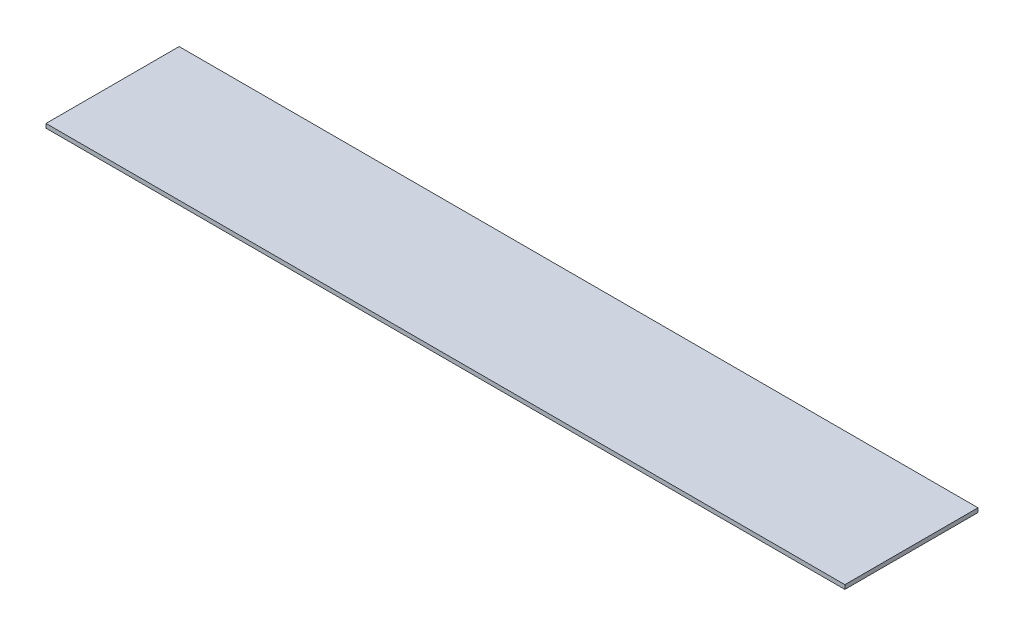
ISO-10303-21;
HEADER;
FILE_DESCRIPTION(('STEP AP214'),'2;1');
FILE_NAME('part.step','',(''),(''),'','','');
FILE_SCHEMA(('AUTOMOTIVE_DESIGN { 1 0 10303 214 1 1 1 1 }'));
ENDSEC;
DATA;
#1=APPLICATION_CONTEXT('core data for automotive mechanical design processes');
#2=APPLICATION_PROTOCOL_DEFINITION('international standard','automotive_design',2000,#1);
#3=PRODUCT_CONTEXT('',#1,'mechanical');
#4=PRODUCT('Part','Part','',(#3));
#5=PRODUCT_RELATED_PRODUCT_CATEGORY('part','',(#4));
#6=PRODUCT_DEFINITION_FORMATION('','',#4);
#7=PRODUCT_DEFINITION_CONTEXT('part definition',#1,'design');
#8=PRODUCT_DEFINITION('design','',#6,#7);
#9=PRODUCT_DEFINITION_SHAPE('','',#8);
#10=(LENGTH_UNIT() NAMED_UNIT(*) SI_UNIT(.MILLI.,.METRE.));
#11=(NAMED_UNIT(*) PLANE_ANGLE_UNIT() SI_UNIT($,.RADIAN.));
#12=(NAMED_UNIT(*) SI_UNIT($,.STERADIAN.) SOLID_ANGLE_UNIT());
#13=UNCERTAINTY_MEASURE_WITH_UNIT(LENGTH_MEASURE(1.E-05),#10,'distance_accuracy_value','');
#14=(GEOMETRIC_REPRESENTATION_CONTEXT(3) GLOBAL_UNCERTAINTY_ASSIGNED_CONTEXT((#13)) GLOBAL_UNIT_ASSIGNED_CONTEXT((#10,
#11,#12)) REPRESENTATION_CONTEXT('',''));
#15=CARTESIAN_POINT('',(0.,0.,0.));
#16=DIRECTION('',(0.,0.,1.));
#17=DIRECTION('',(1.,0.,0.));
#18=AXIS2_PLACEMENT_3D('',#15,#16,#17);
#19=CARTESIAN_POINT('',(0.,1.5875,0.));
#20=DIRECTION('',(1.,0.,0.));
#21=DIRECTION('',(0.,0.,-1.));
#22=AXIS2_PLACEMENT_3D('',#19,#20,#21);
#23=PLANE('',#22);
#24=DIRECTION('',(0.,0.,1.));
#25=VECTOR('',#24,1.);
#26=CARTESIAN_POINT('',(0.,0.,0.));
#27=LINE('',#26,#25);
#28=CARTESIAN_POINT('',(0.,0.,-50.8));
#29=VERTEX_POINT('',#28);
#30=CARTESIAN_POINT('',(0.,0.,0.));
#31=VERTEX_POINT('',#30);
#32=EDGE_CURVE('E96',#29,#31,#27,.T.);
#33=ORIENTED_EDGE('',*,*,#32,.T.);
#34=DIRECTION('',(0.,-1.,0.));
#35=VECTOR('',#34,1.);
#36=CARTESIAN_POINT('',(0.,1.5875,0.));
#37=LINE('',#36,#35);
#38=CARTESIAN_POINT('',(0.,1.5875,0.));
#39=VERTEX_POINT('',#38);
#40=EDGE_CURVE('E11',#39,#31,#37,.T.);
#41=ORIENTED_EDGE('',*,*,#40,.F.);
#42=DIRECTION('',(0.,0.,1.));
#43=VECTOR('',#42,1.);
#44=CARTESIAN_POINT('',(0.,1.5875,0.));
#45=LINE('',#44,#43);
#46=CARTESIAN_POINT('',(0.,1.5875,-50.8));
#47=VERTEX_POINT('',#46);
#48=EDGE_CURVE('E84',#47,#39,#45,.T.);
#49=ORIENTED_EDGE('',*,*,#48,.F.);
#50=DIRECTION('',(0.,-1.,0.));
#51=VECTOR('',#50,1.);
#52=CARTESIAN_POINT('',(0.,1.5875,-50.8));
#53=LINE('',#52,#51);
#54=EDGE_CURVE('E92',#47,#29,#53,.T.);
#55=ORIENTED_EDGE('',*,*,#54,.T.);
#56=EDGE_LOOP('',(#33,#41,#49,#55));
#57=FACE_BOUND('',#56,.T.);
#58=ADVANCED_FACE('F33',(#57),#23,.F.);
#59=CARTESIAN_POINT('',(0.,1.5875,0.));
#60=DIRECTION('',(0.,0.,-1.));
#61=DIRECTION('',(-1.,0.,0.));
#62=AXIS2_PLACEMENT_3D('',#59,#60,#61);
#63=PLANE('',#62);
#64=DIRECTION('',(1.,0.,0.));
#65=VECTOR('',#64,1.);
#66=CARTESIAN_POINT('',(0.,0.,0.));
#67=LINE('',#66,#65);
#68=CARTESIAN_POINT('',(304.8,0.,0.));
#69=VERTEX_POINT('',#68);
#70=EDGE_CURVE('E88',#31,#69,#67,.T.);
#71=ORIENTED_EDGE('',*,*,#70,.T.);
#72=DIRECTION('',(0.,-1.,0.));
#73=VECTOR('',#72,1.);
#74=CARTESIAN_POINT('',(304.8,1.5875,0.));
#75=LINE('',#74,#73);
#76=CARTESIAN_POINT('',(304.8,1.5875,0.));
#77=VERTEX_POINT('',#76);
#78=EDGE_CURVE('E41',#77,#69,#75,.T.);
#79=ORIENTED_EDGE('',*,*,#78,.F.);
#80=DIRECTION('',(1.,0.,0.));
#81=VECTOR('',#80,1.);
#82=CARTESIAN_POINT('',(0.,1.5875,0.));
#83=LINE('',#82,#81);
#84=EDGE_CURVE('E79',#39,#77,#83,.T.);
#85=ORIENTED_EDGE('',*,*,#84,.F.);
#86=ORIENTED_EDGE('',*,*,#40,.T.);
#87=EDGE_LOOP('',(#71,#79,#85,#86));
#88=FACE_BOUND('',#87,.T.);
#89=ADVANCED_FACE('F87',(#88),#63,.F.);
#90=CARTESIAN_POINT('',(304.8,1.5875,0.));
#91=DIRECTION('',(-1.,0.,0.));
#92=DIRECTION('',(0.,0.,1.));
#93=AXIS2_PLACEMENT_3D('',#90,#91,#92);
#94=PLANE('',#93);
#95=DIRECTION('',(0.,0.,-1.));
#96=VECTOR('',#95,1.);
#97=CARTESIAN_POINT('',(304.8,0.,0.));
#98=LINE('',#97,#96);
#99=CARTESIAN_POINT('',(304.8,0.,-50.8));
#100=VERTEX_POINT('',#99);
#101=EDGE_CURVE('E66',#69,#100,#98,.T.);
#102=ORIENTED_EDGE('',*,*,#101,.T.);
#103=DIRECTION('',(0.,-1.,0.));
#104=VECTOR('',#103,1.);
#105=CARTESIAN_POINT('',(304.8,1.5875,-50.8));
#106=LINE('',#105,#104);
#107=CARTESIAN_POINT('',(304.8,1.5875,-50.8));
#108=VERTEX_POINT('',#107);
#109=EDGE_CURVE('E89',#108,#100,#106,.T.);
#110=ORIENTED_EDGE('',*,*,#109,.F.);
#111=DIRECTION('',(0.,0.,-1.));
#112=VECTOR('',#111,1.);
#113=CARTESIAN_POINT('',(304.8,1.5875,0.));
#114=LINE('',#113,#112);
#115=EDGE_CURVE('E82',#77,#108,#114,.T.);
#116=ORIENTED_EDGE('',*,*,#115,.F.);
#117=ORIENTED_EDGE('',*,*,#78,.T.);
#118=EDGE_LOOP('',(#102,#110,#116,#117));
#119=FACE_BOUND('',#118,.T.);
#120=ADVANCED_FACE('F90',(#119),#94,.F.);
#121=CARTESIAN_POINT('',(0.,1.5875,-50.8));
#122=DIRECTION('',(0.,0.,1.));
#123=DIRECTION('',(1.,0.,0.));
#124=AXIS2_PLACEMENT_3D('',#121,#122,#123);
#125=PLANE('',#124);
#126=DIRECTION('',(-1.,0.,0.));
#127=VECTOR('',#126,1.);
#128=CARTESIAN_POINT('',(0.,0.,-50.8));
#129=LINE('',#128,#127);
#130=EDGE_CURVE('E72',#100,#29,#129,.T.);
#131=ORIENTED_EDGE('',*,*,#130,.T.);
#132=ORIENTED_EDGE('',*,*,#54,.F.);
#133=DIRECTION('',(-1.,0.,0.));
#134=VECTOR('',#133,1.);
#135=CARTESIAN_POINT('',(0.,1.5875,-50.8));
#136=LINE('',#135,#134);
#137=EDGE_CURVE('E49',#108,#47,#136,.T.);
#138=ORIENTED_EDGE('',*,*,#137,.F.);
#139=ORIENTED_EDGE('',*,*,#109,.T.);
#140=EDGE_LOOP('',(#131,#132,#138,#139));
#141=FACE_BOUND('',#140,.T.);
#142=ADVANCED_FACE('F103',(#141),#125,.F.);
#143=CARTESIAN_POINT('',(0.,1.5875,0.));
#144=DIRECTION('',(0.,-1.,0.));
#145=DIRECTION('',(0.,0.,-1.));
#146=AXIS2_PLACEMENT_3D('',#143,#144,#145);
#147=PLANE('',#146);
#148=ORIENTED_EDGE('',*,*,#48,.T.);
#149=ORIENTED_EDGE('',*,*,#84,.T.);
#150=ORIENTED_EDGE('',*,*,#115,.T.);
#151=ORIENTED_EDGE('',*,*,#137,.T.);
#152=EDGE_LOOP('',(#148,#149,#150,#151));
#153=FACE_BOUND('',#152,.T.);
#154=ADVANCED_FACE('F80',(#153),#147,.F.);
#155=CARTESIAN_POINT('',(0.,0.,0.));
#156=DIRECTION('',(0.,-1.,0.));
#157=DIRECTION('',(0.,0.,-1.));
#158=AXIS2_PLACEMENT_3D('',#155,#156,#157);
#159=PLANE('',#158);
#160=ORIENTED_EDGE('',*,*,#32,.F.);
#161=ORIENTED_EDGE('',*,*,#130,.F.);
#162=ORIENTED_EDGE('',*,*,#101,.F.);
#163=ORIENTED_EDGE('',*,*,#70,.F.);
#164=EDGE_LOOP('',(#160,#161,#162,#163));
#165=FACE_BOUND('',#164,.T.);
#166=ADVANCED_FACE('F106',(#165),#159,.T.);
#167=CLOSED_SHELL('',(#58,#89,#120,#142,#154,#166));
#168=MANIFOLD_SOLID_BREP('B2',#167);
#169=ADVANCED_BREP_SHAPE_REPRESENTATION('',(#18,#168),#14);
#170=SHAPE_DEFINITION_REPRESENTATION(#9,#169);
ENDSEC;
END-ISO-10303-21;
